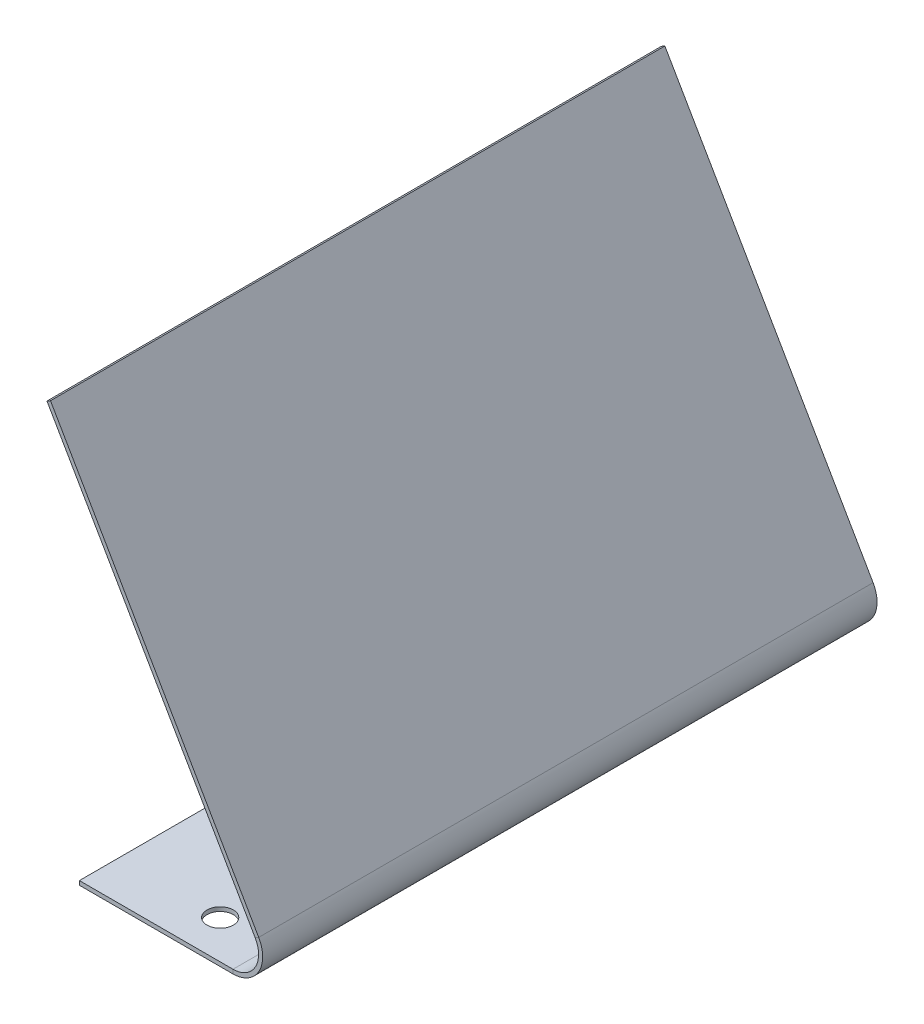
ISO-10303-21;
HEADER;
FILE_DESCRIPTION(('STEP AP214'),'2;1');
FILE_NAME('part.step','',(''),(''),'','','');
FILE_SCHEMA(('AUTOMOTIVE_DESIGN { 1 0 10303 214 1 1 1 1 }'));
ENDSEC;
DATA;
#1=APPLICATION_CONTEXT('core data for automotive mechanical design processes');
#2=APPLICATION_PROTOCOL_DEFINITION('international standard','automotive_design',2000,#1);
#3=PRODUCT_CONTEXT('',#1,'mechanical');
#4=PRODUCT('Part','Part','',(#3));
#5=PRODUCT_RELATED_PRODUCT_CATEGORY('part','',(#4));
#6=PRODUCT_DEFINITION_FORMATION('','',#4);
#7=PRODUCT_DEFINITION_CONTEXT('part definition',#1,'design');
#8=PRODUCT_DEFINITION('design','',#6,#7);
#9=PRODUCT_DEFINITION_SHAPE('','',#8);
#10=(LENGTH_UNIT() NAMED_UNIT(*) SI_UNIT(.MILLI.,.METRE.));
#11=(NAMED_UNIT(*) PLANE_ANGLE_UNIT() SI_UNIT($,.RADIAN.));
#12=(NAMED_UNIT(*) SI_UNIT($,.STERADIAN.) SOLID_ANGLE_UNIT());
#13=UNCERTAINTY_MEASURE_WITH_UNIT(LENGTH_MEASURE(1.E-05),#10,'distance_accuracy_value','');
#14=(GEOMETRIC_REPRESENTATION_CONTEXT(3) GLOBAL_UNCERTAINTY_ASSIGNED_CONTEXT((#13)) GLOBAL_UNIT_ASSIGNED_CONTEXT((#10,
#11,#12)) REPRESENTATION_CONTEXT('',''));
#15=CARTESIAN_POINT('',(0.,0.,0.));
#16=DIRECTION('',(0.,0.,1.));
#17=DIRECTION('',(1.,0.,0.));
#18=AXIS2_PLACEMENT_3D('',#15,#16,#17);
#19=CARTESIAN_POINT('',(-19.05,0.508,0.));
#20=DIRECTION('',(-1.,0.,0.));
#21=DIRECTION('',(0.,0.,1.));
#22=AXIS2_PLACEMENT_3D('',#19,#20,#21);
#23=PLANE('',#22);
#24=DIRECTION('',(0.,1.,0.));
#25=VECTOR('',#24,1.);
#26=CARTESIAN_POINT('',(-19.05,0.508,-76.2));
#27=LINE('',#26,#25);
#28=CARTESIAN_POINT('',(-19.05,0.,-76.2));
#29=VERTEX_POINT('',#28);
#30=CARTESIAN_POINT('',(-19.05,0.508,-76.2));
#31=VERTEX_POINT('',#30);
#32=EDGE_CURVE('E15',#29,#31,#27,.T.);
#33=ORIENTED_EDGE('',*,*,#32,.F.);
#34=DIRECTION('',(0.,0.,1.));
#35=VECTOR('',#34,1.);
#36=CARTESIAN_POINT('',(-19.05,0.,0.));
#37=LINE('',#36,#35);
#38=CARTESIAN_POINT('',(-19.05,0.,0.));
#39=VERTEX_POINT('',#38);
#40=EDGE_CURVE('E148',#29,#39,#37,.T.);
#41=ORIENTED_EDGE('',*,*,#40,.T.);
#42=DIRECTION('',(0.,1.,0.));
#43=VECTOR('',#42,1.);
#44=CARTESIAN_POINT('',(-19.05,0.508,0.));
#45=LINE('',#44,#43);
#46=CARTESIAN_POINT('',(-19.05,0.508,0.));
#47=VERTEX_POINT('',#46);
#48=EDGE_CURVE('E80',#39,#47,#45,.T.);
#49=ORIENTED_EDGE('',*,*,#48,.T.);
#50=DIRECTION('',(0.,0.,1.));
#51=VECTOR('',#50,1.);
#52=CARTESIAN_POINT('',(-19.05,0.508,0.));
#53=LINE('',#52,#51);
#54=EDGE_CURVE('E133',#31,#47,#53,.T.);
#55=ORIENTED_EDGE('',*,*,#54,.F.);
#56=EDGE_LOOP('',(#33,#41,#49,#55));
#57=FACE_BOUND('',#56,.T.);
#58=ADVANCED_FACE('F70',(#57),#23,.T.);
#59=CARTESIAN_POINT('',(0.,0.508,0.));
#60=DIRECTION('',(0.,0.,1.));
#61=DIRECTION('',(1.,0.,0.));
#62=AXIS2_PLACEMENT_3D('',#59,#60,#61);
#63=PLANE('',#62);
#64=ORIENTED_EDGE('',*,*,#48,.F.);
#65=DIRECTION('',(1.,0.,0.));
#66=VECTOR('',#65,1.);
#67=CARTESIAN_POINT('',(0.,0.,0.));
#68=LINE('',#67,#66);
#69=CARTESIAN_POINT('',(0.,0.,0.));
#70=VERTEX_POINT('',#69);
#71=EDGE_CURVE('E146',#39,#70,#68,.T.);
#72=ORIENTED_EDGE('',*,*,#71,.T.);
#73=DIRECTION('',(0.,1.,0.));
#74=VECTOR('',#73,1.);
#75=CARTESIAN_POINT('',(0.,0.508,0.));
#76=LINE('',#75,#74);
#77=CARTESIAN_POINT('',(0.,0.508,0.));
#78=VERTEX_POINT('',#77);
#79=EDGE_CURVE('E88',#70,#78,#76,.T.);
#80=ORIENTED_EDGE('',*,*,#79,.T.);
#81=DIRECTION('',(1.,0.,0.));
#82=VECTOR('',#81,1.);
#83=CARTESIAN_POINT('',(0.,0.508,0.));
#84=LINE('',#83,#82);
#85=EDGE_CURVE('E137',#47,#78,#84,.T.);
#86=ORIENTED_EDGE('',*,*,#85,.F.);
#87=EDGE_LOOP('',(#64,#72,#80,#86));
#88=FACE_BOUND('',#87,.T.);
#89=ADVANCED_FACE('F232',(#88),#63,.T.);
#90=CARTESIAN_POINT('',(0.,0.508,-76.2));
#91=DIRECTION('',(0.,0.,-1.));
#92=DIRECTION('',(-1.,0.,0.));
#93=AXIS2_PLACEMENT_3D('',#90,#91,#92);
#94=PLANE('',#93);
#95=DIRECTION('',(1.,0.,0.));
#96=VECTOR('',#95,1.);
#97=CARTESIAN_POINT('',(0.,0.,-76.2));
#98=LINE('',#97,#96);
#99=CARTESIAN_POINT('',(0.,0.,-76.2));
#100=VERTEX_POINT('',#99);
#101=EDGE_CURVE('E111',#100,#29,#98,.F.);
#102=ORIENTED_EDGE('',*,*,#101,.T.);
#103=ORIENTED_EDGE('',*,*,#32,.T.);
#104=DIRECTION('',(-1.,0.,0.));
#105=VECTOR('',#104,1.);
#106=CARTESIAN_POINT('',(0.,0.508,-76.2));
#107=LINE('',#106,#105);
#108=CARTESIAN_POINT('',(0.,0.508,-76.2));
#109=VERTEX_POINT('',#108);
#110=EDGE_CURVE('E128',#109,#31,#107,.T.);
#111=ORIENTED_EDGE('',*,*,#110,.F.);
#112=DIRECTION('',(0.,1.,0.));
#113=VECTOR('',#112,1.);
#114=CARTESIAN_POINT('',(0.,0.508,-76.2));
#115=LINE('',#114,#113);
#116=EDGE_CURVE('E74',#100,#109,#115,.T.);
#117=ORIENTED_EDGE('',*,*,#116,.F.);
#118=EDGE_LOOP('',(#102,#103,#111,#117));
#119=FACE_BOUND('',#118,.T.);
#120=ADVANCED_FACE('F72',(#119),#94,.T.);
#121=CARTESIAN_POINT('',(0.,0.508,0.));
#122=DIRECTION('',(0.,1.,0.));
#123=DIRECTION('',(0.,0.,1.));
#124=AXIS2_PLACEMENT_3D('',#121,#122,#123);
#125=PLANE('',#124);
#126=CARTESIAN_POINT('',(-6.35,0.508,-71.4375));
#127=DIRECTION('',(0.,1.,0.));
#128=DIRECTION('',(0.,0.,1.));
#129=AXIS2_PLACEMENT_3D('',#126,#127,#128);
#130=CIRCLE('',#129,1.63195);
#131=CARTESIAN_POINT('',(-6.35,0.508,-69.80555));
#132=VERTEX_POINT('',#131);
#133=EDGE_CURVE('E213',#132,#132,#130,.T.);
#134=ORIENTED_EDGE('',*,*,#133,.F.);
#135=EDGE_LOOP('',(#134));
#136=FACE_BOUND('',#135,.T.);
#137=CARTESIAN_POINT('',(-6.35000000000001,0.508,-4.7625));
#138=DIRECTION('',(0.,1.,0.));
#139=DIRECTION('',(0.,0.,1.));
#140=AXIS2_PLACEMENT_3D('',#137,#138,#139);
#141=CIRCLE('',#140,1.63195);
#142=CARTESIAN_POINT('',(-6.35000000000001,0.508,-3.13055));
#143=VERTEX_POINT('',#142);
#144=EDGE_CURVE('E182',#143,#143,#141,.T.);
#145=ORIENTED_EDGE('',*,*,#144,.F.);
#146=EDGE_LOOP('',(#145));
#147=FACE_BOUND('',#146,.T.);
#148=DIRECTION('',(0.,0.,-1.));
#149=VECTOR('',#148,1.);
#150=CARTESIAN_POINT('',(0.,0.508,0.));
#151=LINE('',#150,#149);
#152=EDGE_CURVE('E135',#78,#109,#151,.T.);
#153=ORIENTED_EDGE('',*,*,#152,.T.);
#154=ORIENTED_EDGE('',*,*,#110,.T.);
#155=ORIENTED_EDGE('',*,*,#54,.T.);
#156=ORIENTED_EDGE('',*,*,#85,.T.);
#157=EDGE_LOOP('',(#153,#154,#155,#156));
#158=FACE_BOUND('',#157,.T.);
#159=ADVANCED_FACE('F132',(#136,#147,#158),#125,.T.);
#160=CARTESIAN_POINT('',(0.,0.,0.));
#161=DIRECTION('',(0.,1.,0.));
#162=DIRECTION('',(0.,0.,1.));
#163=AXIS2_PLACEMENT_3D('',#160,#161,#162);
#164=PLANE('',#163);
#165=CARTESIAN_POINT('',(-6.35,0.,-71.4375));
#166=DIRECTION('',(0.,-1.,0.));
#167=DIRECTION('',(0.,0.,-1.));
#168=AXIS2_PLACEMENT_3D('',#165,#166,#167);
#169=CIRCLE('',#168,1.63194999999999);
#170=CARTESIAN_POINT('',(-6.35,0.,-73.06945));
#171=VERTEX_POINT('',#170);
#172=EDGE_CURVE('E216',#171,#171,#169,.T.);
#173=ORIENTED_EDGE('',*,*,#172,.F.);
#174=EDGE_LOOP('',(#173));
#175=FACE_BOUND('',#174,.T.);
#176=CARTESIAN_POINT('',(-6.35000000000001,0.,-4.7625));
#177=DIRECTION('',(0.,-1.,0.));
#178=DIRECTION('',(0.,0.,-1.));
#179=AXIS2_PLACEMENT_3D('',#176,#177,#178);
#180=CIRCLE('',#179,1.63194999999999);
#181=CARTESIAN_POINT('',(-6.35000000000001,0.,-6.39444999999999));
#182=VERTEX_POINT('',#181);
#183=EDGE_CURVE('E210',#182,#182,#180,.T.);
#184=ORIENTED_EDGE('',*,*,#183,.F.);
#185=EDGE_LOOP('',(#184));
#186=FACE_BOUND('',#185,.T.);
#187=DIRECTION('',(0.,0.,1.));
#188=VECTOR('',#187,1.);
#189=CARTESIAN_POINT('',(0.,0.,0.));
#190=LINE('',#189,#188);
#191=EDGE_CURVE('E142',#70,#100,#190,.F.);
#192=ORIENTED_EDGE('',*,*,#191,.F.);
#193=ORIENTED_EDGE('',*,*,#71,.F.);
#194=ORIENTED_EDGE('',*,*,#40,.F.);
#195=ORIENTED_EDGE('',*,*,#101,.F.);
#196=EDGE_LOOP('',(#192,#193,#194,#195));
#197=FACE_BOUND('',#196,.T.);
#198=ADVANCED_FACE('F223',(#175,#186,#197),#164,.F.);
#199=CARTESIAN_POINT('',(0.,3.683,0.));
#200=DIRECTION('',(0.,0.,1.));
#201=DIRECTION('',(1.,0.,0.));
#202=AXIS2_PLACEMENT_3D('',#199,#200,#201);
#203=PLANE('',#202);
#204=DIRECTION('',(-0.86602540378444,-0.499999999999998,0.));
#205=VECTOR('',#204,1.);
#206=CARTESIAN_POINT('',(3.18957156213809,5.52449999999999,0.));
#207=LINE('',#206,#205);
#208=CARTESIAN_POINT('',(2.7496306570156,5.27049999999999,0.));
#209=VERTEX_POINT('',#208);
#210=CARTESIAN_POINT('',(3.18957156213809,5.52449999999999,0.));
#211=VERTEX_POINT('',#210);
#212=EDGE_CURVE('E179',#209,#211,#207,.F.);
#213=ORIENTED_EDGE('',*,*,#212,.F.);
#214=CARTESIAN_POINT('',(0.,3.683,0.));
#215=DIRECTION('',(0.,0.,-1.));
#216=DIRECTION('',(-1.,0.,0.));
#217=AXIS2_PLACEMENT_3D('',#214,#215,#216);
#218=CIRCLE('',#217,3.175);
#219=EDGE_CURVE('E168',#78,#209,#218,.F.);
#220=ORIENTED_EDGE('',*,*,#219,.F.);
#221=ORIENTED_EDGE('',*,*,#79,.F.);
#222=CARTESIAN_POINT('',(0.,3.683,0.));
#223=DIRECTION('',(0.,0.,-1.));
#224=DIRECTION('',(-1.,0.,0.));
#225=AXIS2_PLACEMENT_3D('',#222,#223,#224);
#226=CIRCLE('',#225,3.683);
#227=EDGE_CURVE('E145',#70,#211,#226,.F.);
#228=ORIENTED_EDGE('',*,*,#227,.T.);
#229=EDGE_LOOP('',(#213,#220,#221,#228));
#230=FACE_BOUND('',#229,.T.);
#231=ADVANCED_FACE('F226',(#230),#203,.T.);
#232=CARTESIAN_POINT('',(0.,3.683,-76.2));
#233=DIRECTION('',(0.,0.,1.));
#234=DIRECTION('',(1.,0.,0.));
#235=AXIS2_PLACEMENT_3D('',#232,#233,#234);
#236=PLANE('',#235);
#237=CARTESIAN_POINT('',(0.,3.683,-76.2));
#238=DIRECTION('',(0.,0.,-1.));
#239=DIRECTION('',(-1.,0.,0.));
#240=AXIS2_PLACEMENT_3D('',#237,#238,#239);
#241=CIRCLE('',#240,3.175);
#242=CARTESIAN_POINT('',(2.7496306570156,5.27049999999999,-76.2));
#243=VERTEX_POINT('',#242);
#244=EDGE_CURVE('E158',#243,#109,#241,.T.);
#245=ORIENTED_EDGE('',*,*,#244,.F.);
#246=DIRECTION('',(-0.86602540378444,-0.499999999999998,0.));
#247=VECTOR('',#246,1.);
#248=CARTESIAN_POINT('',(2.7496306570156,5.27049999999999,-76.2));
#249=LINE('',#248,#247);
#250=CARTESIAN_POINT('',(3.18957156213809,5.52449999999999,-76.2));
#251=VERTEX_POINT('',#250);
#252=EDGE_CURVE('E184',#243,#251,#249,.F.);
#253=ORIENTED_EDGE('',*,*,#252,.T.);
#254=CARTESIAN_POINT('',(0.,3.683,-76.2));
#255=DIRECTION('',(0.,0.,-1.));
#256=DIRECTION('',(-1.,0.,0.));
#257=AXIS2_PLACEMENT_3D('',#254,#255,#256);
#258=CIRCLE('',#257,3.683);
#259=EDGE_CURVE('E161',#251,#100,#258,.T.);
#260=ORIENTED_EDGE('',*,*,#259,.T.);
#261=ORIENTED_EDGE('',*,*,#116,.T.);
#262=EDGE_LOOP('',(#245,#253,#260,#261));
#263=FACE_BOUND('',#262,.T.);
#264=ADVANCED_FACE('F156',(#263),#236,.F.);
#265=CARTESIAN_POINT('',(0.,3.683,-76.2));
#266=DIRECTION('',(0.,0.,-1.));
#267=DIRECTION('',(0.86602540378444,0.499999999999998,0.));
#268=AXIS2_PLACEMENT_3D('',#265,#266,#267);
#269=CYLINDRICAL_SURFACE('',#268,3.683);
#270=ORIENTED_EDGE('',*,*,#191,.T.);
#271=ORIENTED_EDGE('',*,*,#259,.F.);
#272=DIRECTION('',(0.,0.,-1.));
#273=VECTOR('',#272,1.);
#274=CARTESIAN_POINT('',(3.18957156213809,5.52449999999999,0.));
#275=LINE('',#274,#273);
#276=EDGE_CURVE('E186',#251,#211,#275,.F.);
#277=ORIENTED_EDGE('',*,*,#276,.T.);
#278=ORIENTED_EDGE('',*,*,#227,.F.);
#279=EDGE_LOOP('',(#270,#271,#277,#278));
#280=FACE_BOUND('',#279,.T.);
#281=ADVANCED_FACE('F234',(#280),#269,.T.);
#282=CARTESIAN_POINT('',(0.,3.683,-76.2));
#283=DIRECTION('',(0.,0.,-1.));
#284=DIRECTION('',(0.86602540378444,0.499999999999998,0.));
#285=AXIS2_PLACEMENT_3D('',#282,#283,#284);
#286=CYLINDRICAL_SURFACE('',#285,3.175);
#287=ORIENTED_EDGE('',*,*,#152,.F.);
#288=ORIENTED_EDGE('',*,*,#219,.T.);
#289=DIRECTION('',(0.,0.,-1.));
#290=VECTOR('',#289,1.);
#291=CARTESIAN_POINT('',(2.7496306570156,5.27049999999999,0.));
#292=LINE('',#291,#290);
#293=EDGE_CURVE('E167',#209,#243,#292,.T.);
#294=ORIENTED_EDGE('',*,*,#293,.T.);
#295=ORIENTED_EDGE('',*,*,#244,.T.);
#296=EDGE_LOOP('',(#287,#288,#294,#295));
#297=FACE_BOUND('',#296,.T.);
#298=ADVANCED_FACE('F163',(#297),#286,.F.);
#299=CARTESIAN_POINT('',(-22.6357977808462,50.2553518262808,-76.2));
#300=DIRECTION('',(0.,0.,1.));
#301=DIRECTION('',(1.,0.,0.));
#302=AXIS2_PLACEMENT_3D('',#299,#300,#301);
#303=PLANE('',#302);
#304=ORIENTED_EDGE('',*,*,#252,.F.);
#305=DIRECTION('',(0.499999999999998,-0.86602540378444,0.));
#306=VECTOR('',#305,1.);
#307=CARTESIAN_POINT('',(-23.0757386859687,50.0013518262808,-76.2));
#308=LINE('',#307,#306);
#309=CARTESIAN_POINT('',(-23.0757386859687,50.0013518262808,-76.2));
#310=VERTEX_POINT('',#309);
#311=EDGE_CURVE('E188',#243,#310,#308,.F.);
#312=ORIENTED_EDGE('',*,*,#311,.T.);
#313=DIRECTION('',(-0.86602540378444,-0.499999999999998,0.));
#314=VECTOR('',#313,1.);
#315=CARTESIAN_POINT('',(-22.6357977808462,50.2553518262808,-76.2));
#316=LINE('',#315,#314);
#317=CARTESIAN_POINT('',(-22.6357977808462,50.2553518262808,-76.2));
#318=VERTEX_POINT('',#317);
#319=EDGE_CURVE('E169',#318,#310,#316,.T.);
#320=ORIENTED_EDGE('',*,*,#319,.F.);
#321=DIRECTION('',(-0.499999999999998,0.86602540378444,0.));
#322=VECTOR('',#321,1.);
#323=CARTESIAN_POINT('',(6.15917267171491,0.380999999999998,-76.2));
#324=LINE('',#323,#322);
#325=EDGE_CURVE('E197',#251,#318,#324,.T.);
#326=ORIENTED_EDGE('',*,*,#325,.F.);
#327=EDGE_LOOP('',(#304,#312,#320,#326));
#328=FACE_BOUND('',#327,.T.);
#329=ADVANCED_FACE('F245',(#328),#303,.F.);
#330=CARTESIAN_POINT('',(5.93920221915367,0.761999999999999,0.));
#331=DIRECTION('',(0.,0.,-1.));
#332=DIRECTION('',(-1.,0.,0.));
#333=AXIS2_PLACEMENT_3D('',#330,#331,#332);
#334=PLANE('',#333);
#335=ORIENTED_EDGE('',*,*,#212,.T.);
#336=DIRECTION('',(0.499999999999998,-0.86602540378444,0.));
#337=VECTOR('',#336,1.);
#338=CARTESIAN_POINT('',(6.15917267171491,0.380999999999998,0.));
#339=LINE('',#338,#337);
#340=CARTESIAN_POINT('',(-22.6357977808462,50.2553518262808,0.));
#341=VERTEX_POINT('',#340);
#342=EDGE_CURVE('E203',#341,#211,#339,.T.);
#343=ORIENTED_EDGE('',*,*,#342,.F.);
#344=DIRECTION('',(-0.86602540378444,-0.499999999999998,0.));
#345=VECTOR('',#344,1.);
#346=CARTESIAN_POINT('',(-22.6357977808462,50.2553518262808,0.));
#347=LINE('',#346,#345);
#348=CARTESIAN_POINT('',(-23.0757386859687,50.0013518262808,0.));
#349=VERTEX_POINT('',#348);
#350=EDGE_CURVE('E173',#341,#349,#347,.T.);
#351=ORIENTED_EDGE('',*,*,#350,.T.);
#352=DIRECTION('',(-0.499999999999998,0.86602540378444,0.));
#353=VECTOR('',#352,1.);
#354=CARTESIAN_POINT('',(5.49926131403117,0.508,0.));
#355=LINE('',#354,#353);
#356=EDGE_CURVE('E194',#349,#209,#355,.F.);
#357=ORIENTED_EDGE('',*,*,#356,.T.);
#358=EDGE_LOOP('',(#335,#343,#351,#357));
#359=FACE_BOUND('',#358,.T.);
#360=ADVANCED_FACE('F260',(#359),#334,.F.);
#361=CARTESIAN_POINT('',(6.15917267171491,0.380999999999998,0.));
#362=DIRECTION('',(-0.86602540378444,-0.499999999999998,0.));
#363=DIRECTION('',(0.499999999999998,-0.86602540378444,0.));
#364=AXIS2_PLACEMENT_3D('',#361,#362,#363);
#365=PLANE('',#364);
#366=ORIENTED_EDGE('',*,*,#276,.F.);
#367=ORIENTED_EDGE('',*,*,#325,.T.);
#368=DIRECTION('',(0.,0.,1.));
#369=VECTOR('',#368,1.);
#370=CARTESIAN_POINT('',(-22.6357977808462,50.2553518262808,0.));
#371=LINE('',#370,#369);
#372=EDGE_CURVE('E200',#318,#341,#371,.T.);
#373=ORIENTED_EDGE('',*,*,#372,.T.);
#374=ORIENTED_EDGE('',*,*,#342,.T.);
#375=EDGE_LOOP('',(#366,#367,#373,#374));
#376=FACE_BOUND('',#375,.T.);
#377=ADVANCED_FACE('F239',(#376),#365,.F.);
#378=CARTESIAN_POINT('',(5.71923176659242,0.126999999999999,0.));
#379=DIRECTION('',(-0.86602540378444,-0.499999999999998,0.));
#380=DIRECTION('',(0.499999999999998,-0.86602540378444,0.));
#381=AXIS2_PLACEMENT_3D('',#378,#379,#380);
#382=PLANE('',#381);
#383=ORIENTED_EDGE('',*,*,#311,.F.);
#384=ORIENTED_EDGE('',*,*,#293,.F.);
#385=ORIENTED_EDGE('',*,*,#356,.F.);
#386=DIRECTION('',(0.,0.,-1.));
#387=VECTOR('',#386,1.);
#388=CARTESIAN_POINT('',(-23.0757386859687,50.0013518262808,0.));
#389=LINE('',#388,#387);
#390=EDGE_CURVE('E191',#310,#349,#389,.F.);
#391=ORIENTED_EDGE('',*,*,#390,.F.);
#392=EDGE_LOOP('',(#383,#384,#385,#391));
#393=FACE_BOUND('',#392,.T.);
#394=ADVANCED_FACE('F261',(#393),#382,.T.);
#395=CARTESIAN_POINT('',(-22.6357977808462,50.2553518262808,0.));
#396=DIRECTION('',(0.499999999999998,-0.86602540378444,0.));
#397=DIRECTION('',(0.86602540378444,0.499999999999998,0.));
#398=AXIS2_PLACEMENT_3D('',#395,#396,#397);
#399=PLANE('',#398);
#400=ORIENTED_EDGE('',*,*,#390,.T.);
#401=ORIENTED_EDGE('',*,*,#350,.F.);
#402=ORIENTED_EDGE('',*,*,#372,.F.);
#403=ORIENTED_EDGE('',*,*,#319,.T.);
#404=EDGE_LOOP('',(#400,#401,#402,#403));
#405=FACE_BOUND('',#404,.T.);
#406=ADVANCED_FACE('F253',(#405),#399,.F.);
#407=CARTESIAN_POINT('',(-6.35000000000001,0.,-4.7625));
#408=DIRECTION('',(0.,-1.,0.));
#409=DIRECTION('',(0.,0.,-1.));
#410=AXIS2_PLACEMENT_3D('',#407,#408,#409);
#411=CYLINDRICAL_SURFACE('',#410,1.63195);
#412=ORIENTED_EDGE('',*,*,#183,.T.);
#413=EDGE_LOOP('',(#412));
#414=FACE_BOUND('',#413,.T.);
#415=ORIENTED_EDGE('',*,*,#144,.T.);
#416=EDGE_LOOP('',(#415));
#417=FACE_BOUND('',#416,.T.);
#418=ADVANCED_FACE('F268',(#414,#417),#411,.F.);
#419=CARTESIAN_POINT('',(-6.35,0.,-71.4375));
#420=DIRECTION('',(0.,-1.,0.));
#421=DIRECTION('',(0.,0.,-1.));
#422=AXIS2_PLACEMENT_3D('',#419,#420,#421);
#423=CYLINDRICAL_SURFACE('',#422,1.63195);
#424=ORIENTED_EDGE('',*,*,#172,.T.);
#425=EDGE_LOOP('',(#424));
#426=FACE_BOUND('',#425,.T.);
#427=ORIENTED_EDGE('',*,*,#133,.T.);
#428=EDGE_LOOP('',(#427));
#429=FACE_BOUND('',#428,.T.);
#430=ADVANCED_FACE('F220',(#426,#429),#423,.F.);
#431=CLOSED_SHELL('',(#58,#89,#120,#159,#198,#231,#264,#281,#298,#329,#360,#377,#394,#406,#418,#430));
#432=MANIFOLD_SOLID_BREP('B2',#431);
#433=ADVANCED_BREP_SHAPE_REPRESENTATION('',(#18,#432),#14);
#434=SHAPE_DEFINITION_REPRESENTATION(#9,#433);
ENDSEC;
END-ISO-10303-21;
